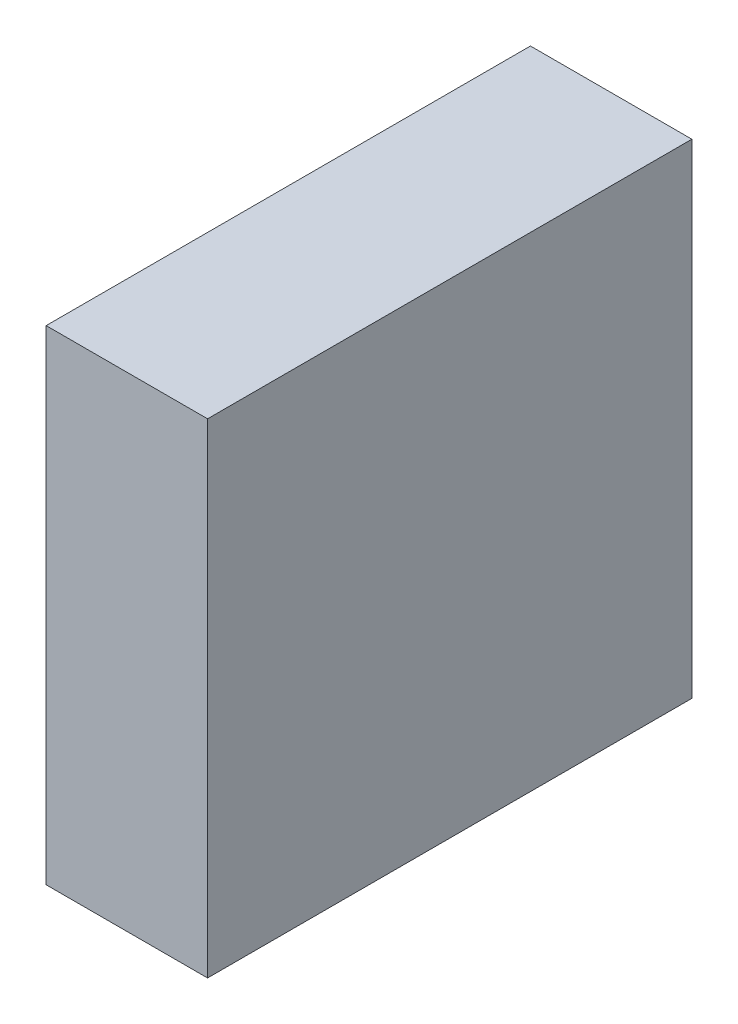
ISO-10303-21;
HEADER;
FILE_DESCRIPTION(('STEP AP214'),'2;1');
FILE_NAME('part.step','',(''),(''),'','','');
FILE_SCHEMA(('AUTOMOTIVE_DESIGN { 1 0 10303 214 1 1 1 1 }'));
ENDSEC;
DATA;
#1=APPLICATION_CONTEXT('core data for automotive mechanical design processes');
#2=APPLICATION_PROTOCOL_DEFINITION('international standard','automotive_design',2000,#1);
#3=PRODUCT_CONTEXT('',#1,'mechanical');
#4=PRODUCT('Part','Part','',(#3));
#5=PRODUCT_RELATED_PRODUCT_CATEGORY('part','',(#4));
#6=PRODUCT_DEFINITION_FORMATION('','',#4);
#7=PRODUCT_DEFINITION_CONTEXT('part definition',#1,'design');
#8=PRODUCT_DEFINITION('design','',#6,#7);
#9=PRODUCT_DEFINITION_SHAPE('','',#8);
#10=(LENGTH_UNIT() NAMED_UNIT(*) SI_UNIT(.MILLI.,.METRE.));
#11=(NAMED_UNIT(*) PLANE_ANGLE_UNIT() SI_UNIT($,.RADIAN.));
#12=(NAMED_UNIT(*) SI_UNIT($,.STERADIAN.) SOLID_ANGLE_UNIT());
#13=UNCERTAINTY_MEASURE_WITH_UNIT(LENGTH_MEASURE(1.E-05),#10,'distance_accuracy_value','');
#14=(GEOMETRIC_REPRESENTATION_CONTEXT(3) GLOBAL_UNCERTAINTY_ASSIGNED_CONTEXT((#13)) GLOBAL_UNIT_ASSIGNED_CONTEXT((#10,
#11,#12)) REPRESENTATION_CONTEXT('',''));
#15=CARTESIAN_POINT('',(0.,0.,0.));
#16=DIRECTION('',(0.,0.,1.));
#17=DIRECTION('',(1.,0.,0.));
#18=AXIS2_PLACEMENT_3D('',#15,#16,#17);
#19=CARTESIAN_POINT('',(0.,9.,0.));
#20=DIRECTION('',(0.,0.,-1.));
#21=DIRECTION('',(-1.,0.,0.));
#22=AXIS2_PLACEMENT_3D('',#19,#20,#21);
#23=PLANE('',#22);
#24=DIRECTION('',(1.,0.,0.));
#25=VECTOR('',#24,1.);
#26=CARTESIAN_POINT('',(0.,0.,0.));
#27=LINE('',#26,#25);
#28=CARTESIAN_POINT('',(0.,0.,0.));
#29=VERTEX_POINT('',#28);
#30=CARTESIAN_POINT('',(3.,0.,0.));
#31=VERTEX_POINT('',#30);
#32=EDGE_CURVE('E96',#29,#31,#27,.T.);
#33=ORIENTED_EDGE('',*,*,#32,.T.);
#34=DIRECTION('',(0.,-1.,0.));
#35=VECTOR('',#34,1.);
#36=CARTESIAN_POINT('',(3.,9.,0.));
#37=LINE('',#36,#35);
#38=CARTESIAN_POINT('',(3.,9.,0.));
#39=VERTEX_POINT('',#38);
#40=EDGE_CURVE('E11',#39,#31,#37,.T.);
#41=ORIENTED_EDGE('',*,*,#40,.F.);
#42=DIRECTION('',(1.,0.,0.));
#43=VECTOR('',#42,1.);
#44=CARTESIAN_POINT('',(0.,9.,0.));
#45=LINE('',#44,#43);
#46=CARTESIAN_POINT('',(0.,9.,0.));
#47=VERTEX_POINT('',#46);
#48=EDGE_CURVE('E84',#47,#39,#45,.T.);
#49=ORIENTED_EDGE('',*,*,#48,.F.);
#50=DIRECTION('',(0.,-1.,0.));
#51=VECTOR('',#50,1.);
#52=CARTESIAN_POINT('',(0.,9.,0.));
#53=LINE('',#52,#51);
#54=EDGE_CURVE('E92',#47,#29,#53,.T.);
#55=ORIENTED_EDGE('',*,*,#54,.T.);
#56=EDGE_LOOP('',(#33,#41,#49,#55));
#57=FACE_BOUND('',#56,.T.);
#58=ADVANCED_FACE('F33',(#57),#23,.F.);
#59=CARTESIAN_POINT('',(3.,9.,0.));
#60=DIRECTION('',(-1.,0.,0.));
#61=DIRECTION('',(0.,0.,1.));
#62=AXIS2_PLACEMENT_3D('',#59,#60,#61);
#63=PLANE('',#62);
#64=DIRECTION('',(0.,0.,-1.));
#65=VECTOR('',#64,1.);
#66=CARTESIAN_POINT('',(3.,0.,0.));
#67=LINE('',#66,#65);
#68=CARTESIAN_POINT('',(3.,0.,-9.));
#69=VERTEX_POINT('',#68);
#70=EDGE_CURVE('E88',#31,#69,#67,.T.);
#71=ORIENTED_EDGE('',*,*,#70,.T.);
#72=DIRECTION('',(0.,-1.,0.));
#73=VECTOR('',#72,1.);
#74=CARTESIAN_POINT('',(3.,9.,-9.));
#75=LINE('',#74,#73);
#76=CARTESIAN_POINT('',(3.,9.,-9.));
#77=VERTEX_POINT('',#76);
#78=EDGE_CURVE('E41',#77,#69,#75,.T.);
#79=ORIENTED_EDGE('',*,*,#78,.F.);
#80=DIRECTION('',(0.,0.,-1.));
#81=VECTOR('',#80,1.);
#82=CARTESIAN_POINT('',(3.,9.,0.));
#83=LINE('',#82,#81);
#84=EDGE_CURVE('E79',#39,#77,#83,.T.);
#85=ORIENTED_EDGE('',*,*,#84,.F.);
#86=ORIENTED_EDGE('',*,*,#40,.T.);
#87=EDGE_LOOP('',(#71,#79,#85,#86));
#88=FACE_BOUND('',#87,.T.);
#89=ADVANCED_FACE('F87',(#88),#63,.F.);
#90=CARTESIAN_POINT('',(3.,9.,-9.));
#91=DIRECTION('',(0.,0.,1.));
#92=DIRECTION('',(1.,0.,0.));
#93=AXIS2_PLACEMENT_3D('',#90,#91,#92);
#94=PLANE('',#93);
#95=DIRECTION('',(-1.,0.,0.));
#96=VECTOR('',#95,1.);
#97=CARTESIAN_POINT('',(3.,0.,-9.));
#98=LINE('',#97,#96);
#99=CARTESIAN_POINT('',(0.,0.,-9.));
#100=VERTEX_POINT('',#99);
#101=EDGE_CURVE('E66',#69,#100,#98,.T.);
#102=ORIENTED_EDGE('',*,*,#101,.T.);
#103=DIRECTION('',(0.,-1.,0.));
#104=VECTOR('',#103,1.);
#105=CARTESIAN_POINT('',(0.,9.,-9.));
#106=LINE('',#105,#104);
#107=CARTESIAN_POINT('',(0.,9.,-9.));
#108=VERTEX_POINT('',#107);
#109=EDGE_CURVE('E89',#108,#100,#106,.T.);
#110=ORIENTED_EDGE('',*,*,#109,.F.);
#111=DIRECTION('',(-1.,0.,0.));
#112=VECTOR('',#111,1.);
#113=CARTESIAN_POINT('',(3.,9.,-9.));
#114=LINE('',#113,#112);
#115=EDGE_CURVE('E82',#77,#108,#114,.T.);
#116=ORIENTED_EDGE('',*,*,#115,.F.);
#117=ORIENTED_EDGE('',*,*,#78,.T.);
#118=EDGE_LOOP('',(#102,#110,#116,#117));
#119=FACE_BOUND('',#118,.T.);
#120=ADVANCED_FACE('F90',(#119),#94,.F.);
#121=CARTESIAN_POINT('',(0.,9.,0.));
#122=DIRECTION('',(1.,0.,0.));
#123=DIRECTION('',(0.,0.,-1.));
#124=AXIS2_PLACEMENT_3D('',#121,#122,#123);
#125=PLANE('',#124);
#126=DIRECTION('',(0.,0.,1.));
#127=VECTOR('',#126,1.);
#128=CARTESIAN_POINT('',(0.,0.,0.));
#129=LINE('',#128,#127);
#130=EDGE_CURVE('E72',#100,#29,#129,.T.);
#131=ORIENTED_EDGE('',*,*,#130,.T.);
#132=ORIENTED_EDGE('',*,*,#54,.F.);
#133=DIRECTION('',(0.,0.,1.));
#134=VECTOR('',#133,1.);
#135=CARTESIAN_POINT('',(0.,9.,0.));
#136=LINE('',#135,#134);
#137=EDGE_CURVE('E49',#108,#47,#136,.T.);
#138=ORIENTED_EDGE('',*,*,#137,.F.);
#139=ORIENTED_EDGE('',*,*,#109,.T.);
#140=EDGE_LOOP('',(#131,#132,#138,#139));
#141=FACE_BOUND('',#140,.T.);
#142=ADVANCED_FACE('F103',(#141),#125,.F.);
#143=CARTESIAN_POINT('',(0.,9.,0.));
#144=DIRECTION('',(0.,1.,0.));
#145=DIRECTION('',(0.,0.,1.));
#146=AXIS2_PLACEMENT_3D('',#143,#144,#145);
#147=PLANE('',#146);
#148=ORIENTED_EDGE('',*,*,#48,.T.);
#149=ORIENTED_EDGE('',*,*,#84,.T.);
#150=ORIENTED_EDGE('',*,*,#115,.T.);
#151=ORIENTED_EDGE('',*,*,#137,.T.);
#152=EDGE_LOOP('',(#148,#149,#150,#151));
#153=FACE_BOUND('',#152,.T.);
#154=ADVANCED_FACE('F80',(#153),#147,.T.);
#155=CARTESIAN_POINT('',(0.,0.,0.));
#156=DIRECTION('',(0.,1.,0.));
#157=DIRECTION('',(0.,0.,1.));
#158=AXIS2_PLACEMENT_3D('',#155,#156,#157);
#159=PLANE('',#158);
#160=ORIENTED_EDGE('',*,*,#32,.F.);
#161=ORIENTED_EDGE('',*,*,#130,.F.);
#162=ORIENTED_EDGE('',*,*,#101,.F.);
#163=ORIENTED_EDGE('',*,*,#70,.F.);
#164=EDGE_LOOP('',(#160,#161,#162,#163));
#165=FACE_BOUND('',#164,.T.);
#166=ADVANCED_FACE('F106',(#165),#159,.F.);
#167=CLOSED_SHELL('',(#58,#89,#120,#142,#154,#166));
#168=MANIFOLD_SOLID_BREP('B2',#167);
#169=ADVANCED_BREP_SHAPE_REPRESENTATION('',(#18,#168),#14);
#170=SHAPE_DEFINITION_REPRESENTATION(#9,#169);
ENDSEC;
END-ISO-10303-21;
